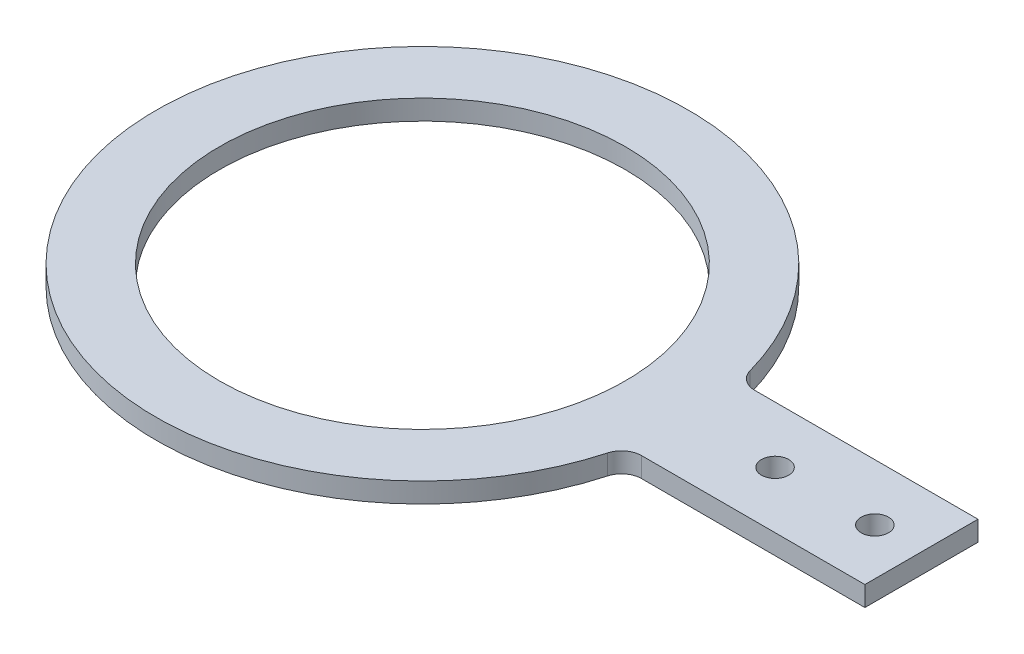
ISO-10303-21;
HEADER;
FILE_DESCRIPTION(('STEP AP214'),'2;1');
FILE_NAME('part.step','',(''),(''),'','','');
FILE_SCHEMA(('AUTOMOTIVE_DESIGN { 1 0 10303 214 1 1 1 1 }'));
ENDSEC;
DATA;
#1=APPLICATION_CONTEXT('core data for automotive mechanical design processes');
#2=APPLICATION_PROTOCOL_DEFINITION('international standard','automotive_design',2000,#1);
#3=PRODUCT_CONTEXT('',#1,'mechanical');
#4=PRODUCT('Part','Part','',(#3));
#5=PRODUCT_RELATED_PRODUCT_CATEGORY('part','',(#4));
#6=PRODUCT_DEFINITION_FORMATION('','',#4);
#7=PRODUCT_DEFINITION_CONTEXT('part definition',#1,'design');
#8=PRODUCT_DEFINITION('design','',#6,#7);
#9=PRODUCT_DEFINITION_SHAPE('','',#8);
#10=(LENGTH_UNIT() NAMED_UNIT(*) SI_UNIT(.MILLI.,.METRE.));
#11=(NAMED_UNIT(*) PLANE_ANGLE_UNIT() SI_UNIT($,.RADIAN.));
#12=(NAMED_UNIT(*) SI_UNIT($,.STERADIAN.) SOLID_ANGLE_UNIT());
#13=UNCERTAINTY_MEASURE_WITH_UNIT(LENGTH_MEASURE(1.E-05),#10,'distance_accuracy_value','');
#14=(GEOMETRIC_REPRESENTATION_CONTEXT(3) GLOBAL_UNCERTAINTY_ASSIGNED_CONTEXT((#13)) GLOBAL_UNIT_ASSIGNED_CONTEXT((#10,
#11,#12)) REPRESENTATION_CONTEXT('',''));
#15=CARTESIAN_POINT('',(0.,0.,0.));
#16=DIRECTION('',(0.,0.,1.));
#17=DIRECTION('',(1.,0.,0.));
#18=AXIS2_PLACEMENT_3D('',#15,#16,#17);
#19=CARTESIAN_POINT('',(0.,3.,0.));
#20=DIRECTION('',(0.,1.,0.));
#21=DIRECTION('',(0.,0.,1.));
#22=AXIS2_PLACEMENT_3D('',#19,#20,#21);
#23=PLANE('',#22);
#24=CARTESIAN_POINT('',(53.,3.,0.));
#25=DIRECTION('',(0.,1.,0.));
#26=DIRECTION('',(0.,0.,1.));
#27=AXIS2_PLACEMENT_3D('',#24,#25,#26);
#28=CIRCLE('',#27,2.05);
#29=CARTESIAN_POINT('',(53.,3.,2.05));
#30=VERTEX_POINT('',#29);
#31=EDGE_CURVE('E205',#30,#30,#28,.T.);
#32=ORIENTED_EDGE('',*,*,#31,.F.);
#33=EDGE_LOOP('',(#32));
#34=FACE_BOUND('',#33,.T.);
#35=CARTESIAN_POINT('',(68.,3.,0.));
#36=DIRECTION('',(0.,1.,0.));
#37=DIRECTION('',(0.,0.,1.));
#38=AXIS2_PLACEMENT_3D('',#35,#36,#37);
#39=CIRCLE('',#38,2.04999999999999);
#40=CARTESIAN_POINT('',(68.,3.,2.04999999999999));
#41=VERTEX_POINT('',#40);
#42=EDGE_CURVE('E203',#41,#41,#39,.T.);
#43=ORIENTED_EDGE('',*,*,#42,.F.);
#44=EDGE_LOOP('',(#43));
#45=FACE_BOUND('',#44,.T.);
#46=DIRECTION('',(-1.,0.,0.));
#47=VECTOR('',#46,1.);
#48=CARTESIAN_POINT('',(35.,3.,-8.5));
#49=LINE('',#48,#47);
#50=CARTESIAN_POINT('',(75.,3.,-8.5));
#51=VERTEX_POINT('',#50);
#52=CARTESIAN_POINT('',(41.4336819507994,3.,-8.5));
#53=VERTEX_POINT('',#52);
#54=EDGE_CURVE('E104',#51,#53,#49,.T.);
#55=ORIENTED_EDGE('',*,*,#54,.T.);
#56=CARTESIAN_POINT('',(41.4336819507994,3.,-11.5));
#57=DIRECTION('',(0.,1.,0.));
#58=DIRECTION('',(0.,0.,1.));
#59=AXIS2_PLACEMENT_3D('',#56,#57,#58);
#60=CIRCLE('',#59,3.);
#61=CARTESIAN_POINT('',(38.542959954232,3.,-10.6976744186046));
#62=VERTEX_POINT('',#61);
#63=EDGE_CURVE('E11',#53,#62,#60,.F.);
#64=ORIENTED_EDGE('',*,*,#63,.T.);
#65=CARTESIAN_POINT('',(0.,3.,0.));
#66=DIRECTION('',(0.,1.,0.));
#67=DIRECTION('',(0.,0.,1.));
#68=AXIS2_PLACEMENT_3D('',#65,#66,#67);
#69=CIRCLE('',#68,40.);
#70=CARTESIAN_POINT('',(38.542959954232,3.,10.6976744186046));
#71=VERTEX_POINT('',#70);
#72=EDGE_CURVE('E123',#62,#71,#69,.T.);
#73=ORIENTED_EDGE('',*,*,#72,.T.);
#74=CARTESIAN_POINT('',(41.4336819507994,3.,11.5));
#75=DIRECTION('',(0.,1.,0.));
#76=DIRECTION('',(0.,0.,1.));
#77=AXIS2_PLACEMENT_3D('',#74,#75,#76);
#78=CIRCLE('',#77,3.);
#79=CARTESIAN_POINT('',(41.4336819507994,3.,8.5));
#80=VERTEX_POINT('',#79);
#81=EDGE_CURVE('E90',#71,#80,#78,.F.);
#82=ORIENTED_EDGE('',*,*,#81,.T.);
#83=DIRECTION('',(1.,0.,0.));
#84=VECTOR('',#83,1.);
#85=CARTESIAN_POINT('',(35.,3.,8.5));
#86=LINE('',#85,#84);
#87=CARTESIAN_POINT('',(75.,3.,8.5));
#88=VERTEX_POINT('',#87);
#89=EDGE_CURVE('E84',#80,#88,#86,.T.);
#90=ORIENTED_EDGE('',*,*,#89,.T.);
#91=DIRECTION('',(0.,0.,-1.));
#92=VECTOR('',#91,1.);
#93=CARTESIAN_POINT('',(75.,3.,-8.5));
#94=LINE('',#93,#92);
#95=EDGE_CURVE('E88',#88,#51,#94,.T.);
#96=ORIENTED_EDGE('',*,*,#95,.T.);
#97=EDGE_LOOP('',(#55,#64,#73,#82,#90,#96));
#98=FACE_BOUND('',#97,.T.);
#99=CARTESIAN_POINT('',(0.,3.,0.));
#100=DIRECTION('',(0.,1.,0.));
#101=DIRECTION('',(0.,0.,1.));
#102=AXIS2_PLACEMENT_3D('',#99,#100,#101);
#103=CIRCLE('',#102,30.5);
#104=CARTESIAN_POINT('',(0.,3.,30.5));
#105=VERTEX_POINT('',#104);
#106=EDGE_CURVE('E117',#105,#105,#103,.T.);
#107=ORIENTED_EDGE('',*,*,#106,.F.);
#108=EDGE_LOOP('',(#107));
#109=FACE_BOUND('',#108,.T.);
#110=ADVANCED_FACE('F32',(#34,#45,#98,#109),#23,.T.);
#111=CARTESIAN_POINT('',(0.,0.,0.));
#112=DIRECTION('',(0.,1.,0.));
#113=DIRECTION('',(0.,0.,1.));
#114=AXIS2_PLACEMENT_3D('',#111,#112,#113);
#115=PLANE('',#114);
#116=CARTESIAN_POINT('',(53.,0.,0.));
#117=DIRECTION('',(0.,1.,0.));
#118=DIRECTION('',(0.,0.,1.));
#119=AXIS2_PLACEMENT_3D('',#116,#117,#118);
#120=CIRCLE('',#119,2.05);
#121=CARTESIAN_POINT('',(53.,0.,2.05));
#122=VERTEX_POINT('',#121);
#123=EDGE_CURVE('E93',#122,#122,#120,.T.);
#124=ORIENTED_EDGE('',*,*,#123,.T.);
#125=EDGE_LOOP('',(#124));
#126=FACE_BOUND('',#125,.T.);
#127=CARTESIAN_POINT('',(68.,0.,0.));
#128=DIRECTION('',(0.,1.,0.));
#129=DIRECTION('',(0.,0.,1.));
#130=AXIS2_PLACEMENT_3D('',#127,#128,#129);
#131=CIRCLE('',#130,2.04999999999999);
#132=CARTESIAN_POINT('',(68.,0.,2.04999999999999));
#133=VERTEX_POINT('',#132);
#134=EDGE_CURVE('E200',#133,#133,#131,.T.);
#135=ORIENTED_EDGE('',*,*,#134,.T.);
#136=EDGE_LOOP('',(#135));
#137=FACE_BOUND('',#136,.T.);
#138=CARTESIAN_POINT('',(0.,0.,0.));
#139=DIRECTION('',(0.,1.,0.));
#140=DIRECTION('',(0.,0.,1.));
#141=AXIS2_PLACEMENT_3D('',#138,#139,#140);
#142=CIRCLE('',#141,40.);
#143=CARTESIAN_POINT('',(38.542959954232,0.,-10.6976744186046));
#144=VERTEX_POINT('',#143);
#145=CARTESIAN_POINT('',(38.542959954232,0.,10.6976744186046));
#146=VERTEX_POINT('',#145);
#147=EDGE_CURVE('E120',#144,#146,#142,.T.);
#148=ORIENTED_EDGE('',*,*,#147,.F.);
#149=CARTESIAN_POINT('',(41.4336819507994,0.,-11.5));
#150=DIRECTION('',(0.,1.,0.));
#151=DIRECTION('',(0.,0.,1.));
#152=AXIS2_PLACEMENT_3D('',#149,#150,#151);
#153=CIRCLE('',#152,3.);
#154=CARTESIAN_POINT('',(41.4336819507994,0.,-8.5));
#155=VERTEX_POINT('',#154);
#156=EDGE_CURVE('E40',#144,#155,#153,.T.);
#157=ORIENTED_EDGE('',*,*,#156,.T.);
#158=DIRECTION('',(1.,0.,0.));
#159=VECTOR('',#158,1.);
#160=CARTESIAN_POINT('',(35.,0.,-8.5));
#161=LINE('',#160,#159);
#162=CARTESIAN_POINT('',(75.,0.,-8.5));
#163=VERTEX_POINT('',#162);
#164=EDGE_CURVE('E116',#155,#163,#161,.T.);
#165=ORIENTED_EDGE('',*,*,#164,.T.);
#166=DIRECTION('',(0.,0.,1.));
#167=VECTOR('',#166,1.);
#168=CARTESIAN_POINT('',(75.,0.,-8.5));
#169=LINE('',#168,#167);
#170=CARTESIAN_POINT('',(75.,0.,8.5));
#171=VERTEX_POINT('',#170);
#172=EDGE_CURVE('E112',#163,#171,#169,.T.);
#173=ORIENTED_EDGE('',*,*,#172,.T.);
#174=DIRECTION('',(-1.,0.,0.));
#175=VECTOR('',#174,1.);
#176=CARTESIAN_POINT('',(35.,0.,8.5));
#177=LINE('',#176,#175);
#178=CARTESIAN_POINT('',(41.4336819507994,0.,8.5));
#179=VERTEX_POINT('',#178);
#180=EDGE_CURVE('E100',#171,#179,#177,.T.);
#181=ORIENTED_EDGE('',*,*,#180,.T.);
#182=CARTESIAN_POINT('',(41.4336819507994,0.,11.5));
#183=DIRECTION('',(0.,1.,0.));
#184=DIRECTION('',(0.,0.,1.));
#185=AXIS2_PLACEMENT_3D('',#182,#183,#184);
#186=CIRCLE('',#185,3.);
#187=EDGE_CURVE('E137',#179,#146,#186,.T.);
#188=ORIENTED_EDGE('',*,*,#187,.T.);
#189=EDGE_LOOP('',(#148,#157,#165,#173,#181,#188));
#190=FACE_BOUND('',#189,.T.);
#191=CARTESIAN_POINT('',(0.,0.,0.));
#192=DIRECTION('',(0.,1.,0.));
#193=DIRECTION('',(0.,0.,1.));
#194=AXIS2_PLACEMENT_3D('',#191,#192,#193);
#195=CIRCLE('',#194,30.5);
#196=CARTESIAN_POINT('',(0.,0.,30.5));
#197=VERTEX_POINT('',#196);
#198=EDGE_CURVE('E115',#197,#197,#195,.T.);
#199=ORIENTED_EDGE('',*,*,#198,.T.);
#200=EDGE_LOOP('',(#199));
#201=FACE_BOUND('',#200,.T.);
#202=ADVANCED_FACE('F139',(#126,#137,#190,#201),#115,.F.);
#203=CARTESIAN_POINT('',(0.,3.,0.));
#204=DIRECTION('',(0.,-1.,0.));
#205=DIRECTION('',(0.,0.,-1.));
#206=AXIS2_PLACEMENT_3D('',#203,#204,#205);
#207=CYLINDRICAL_SURFACE('',#206,40.);
#208=ORIENTED_EDGE('',*,*,#147,.T.);
#209=DIRECTION('',(0.,-1.,0.));
#210=VECTOR('',#209,1.);
#211=CARTESIAN_POINT('',(38.542959954232,3.,10.6976744186047));
#212=LINE('',#211,#210);
#213=EDGE_CURVE('E130',#146,#71,#212,.F.);
#214=ORIENTED_EDGE('',*,*,#213,.T.);
#215=ORIENTED_EDGE('',*,*,#72,.F.);
#216=DIRECTION('',(0.,-1.,0.));
#217=VECTOR('',#216,1.);
#218=CARTESIAN_POINT('',(38.542959954232,3.,-10.6976744186047));
#219=LINE('',#218,#217);
#220=EDGE_CURVE('E125',#62,#144,#219,.T.);
#221=ORIENTED_EDGE('',*,*,#220,.T.);
#222=EDGE_LOOP('',(#208,#214,#215,#221));
#223=FACE_BOUND('',#222,.T.);
#224=ADVANCED_FACE('F144',(#223),#207,.T.);
#225=CARTESIAN_POINT('',(0.,3.,0.));
#226=DIRECTION('',(0.,-1.,0.));
#227=DIRECTION('',(0.,0.,-1.));
#228=AXIS2_PLACEMENT_3D('',#225,#226,#227);
#229=CYLINDRICAL_SURFACE('',#228,30.5);
#230=ORIENTED_EDGE('',*,*,#106,.T.);
#231=EDGE_LOOP('',(#230));
#232=FACE_BOUND('',#231,.T.);
#233=ORIENTED_EDGE('',*,*,#198,.F.);
#234=EDGE_LOOP('',(#233));
#235=FACE_BOUND('',#234,.T.);
#236=ADVANCED_FACE('F170',(#232,#235),#229,.F.);
#237=CARTESIAN_POINT('',(35.,-43.4626276242015,-8.5));
#238=DIRECTION('',(0.,0.,-1.));
#239=DIRECTION('',(-1.,0.,0.));
#240=AXIS2_PLACEMENT_3D('',#237,#238,#239);
#241=PLANE('',#240);
#242=ORIENTED_EDGE('',*,*,#164,.F.);
#243=DIRECTION('',(0.,-1.,0.));
#244=VECTOR('',#243,1.);
#245=CARTESIAN_POINT('',(41.4336819507994,-43.4626276242015,-8.5));
#246=LINE('',#245,#244);
#247=EDGE_CURVE('E53',#155,#53,#246,.F.);
#248=ORIENTED_EDGE('',*,*,#247,.T.);
#249=ORIENTED_EDGE('',*,*,#54,.F.);
#250=DIRECTION('',(0.,1.,0.));
#251=VECTOR('',#250,1.);
#252=CARTESIAN_POINT('',(75.,-43.4626276242015,-8.5));
#253=LINE('',#252,#251);
#254=EDGE_CURVE('E103',#163,#51,#253,.T.);
#255=ORIENTED_EDGE('',*,*,#254,.F.);
#256=EDGE_LOOP('',(#242,#248,#249,#255));
#257=FACE_BOUND('',#256,.T.);
#258=ADVANCED_FACE('F176',(#257),#241,.T.);
#259=CARTESIAN_POINT('',(35.,-43.4626276242015,8.5));
#260=DIRECTION('',(0.,0.,1.));
#261=DIRECTION('',(1.,0.,0.));
#262=AXIS2_PLACEMENT_3D('',#259,#260,#261);
#263=PLANE('',#262);
#264=ORIENTED_EDGE('',*,*,#89,.F.);
#265=DIRECTION('',(0.,-1.,0.));
#266=VECTOR('',#265,1.);
#267=CARTESIAN_POINT('',(41.4336819507994,-43.4626276242015,8.5));
#268=LINE('',#267,#266);
#269=EDGE_CURVE('E133',#80,#179,#268,.T.);
#270=ORIENTED_EDGE('',*,*,#269,.T.);
#271=ORIENTED_EDGE('',*,*,#180,.F.);
#272=DIRECTION('',(0.,1.,0.));
#273=VECTOR('',#272,1.);
#274=CARTESIAN_POINT('',(75.,-43.4626276242015,8.5));
#275=LINE('',#274,#273);
#276=EDGE_CURVE('E97',#171,#88,#275,.T.);
#277=ORIENTED_EDGE('',*,*,#276,.T.);
#278=EDGE_LOOP('',(#264,#270,#271,#277));
#279=FACE_BOUND('',#278,.T.);
#280=ADVANCED_FACE('F98',(#279),#263,.T.);
#281=CARTESIAN_POINT('',(75.,-43.4626276242015,-8.5));
#282=DIRECTION('',(1.,0.,0.));
#283=DIRECTION('',(0.,0.,-1.));
#284=AXIS2_PLACEMENT_3D('',#281,#282,#283);
#285=PLANE('',#284);
#286=ORIENTED_EDGE('',*,*,#172,.F.);
#287=ORIENTED_EDGE('',*,*,#254,.T.);
#288=ORIENTED_EDGE('',*,*,#95,.F.);
#289=ORIENTED_EDGE('',*,*,#276,.F.);
#290=EDGE_LOOP('',(#286,#287,#288,#289));
#291=FACE_BOUND('',#290,.T.);
#292=ADVANCED_FACE('F106',(#291),#285,.T.);
#293=CARTESIAN_POINT('',(68.,0.,0.));
#294=DIRECTION('',(0.,1.,0.));
#295=DIRECTION('',(0.,0.,1.));
#296=AXIS2_PLACEMENT_3D('',#293,#294,#295);
#297=CYLINDRICAL_SURFACE('',#296,2.04999999999999);
#298=ORIENTED_EDGE('',*,*,#134,.F.);
#299=EDGE_LOOP('',(#298));
#300=FACE_BOUND('',#299,.T.);
#301=ORIENTED_EDGE('',*,*,#42,.T.);
#302=EDGE_LOOP('',(#301));
#303=FACE_BOUND('',#302,.T.);
#304=ADVANCED_FACE('F155',(#300,#303),#297,.F.);
#305=CARTESIAN_POINT('',(53.,0.,0.));
#306=DIRECTION('',(0.,1.,0.));
#307=DIRECTION('',(0.,0.,1.));
#308=AXIS2_PLACEMENT_3D('',#305,#306,#307);
#309=CYLINDRICAL_SURFACE('',#308,2.05);
#310=ORIENTED_EDGE('',*,*,#123,.F.);
#311=EDGE_LOOP('',(#310));
#312=FACE_BOUND('',#311,.T.);
#313=ORIENTED_EDGE('',*,*,#31,.T.);
#314=EDGE_LOOP('',(#313));
#315=FACE_BOUND('',#314,.T.);
#316=ADVANCED_FACE('F149',(#312,#315),#309,.F.);
#317=CARTESIAN_POINT('',(41.4336819507994,3.,11.5));
#318=DIRECTION('',(0.,-1.,0.));
#319=DIRECTION('',(0.,0.,-1.));
#320=AXIS2_PLACEMENT_3D('',#317,#318,#319);
#321=CYLINDRICAL_SURFACE('',#320,3.);
#322=ORIENTED_EDGE('',*,*,#187,.F.);
#323=ORIENTED_EDGE('',*,*,#269,.F.);
#324=ORIENTED_EDGE('',*,*,#81,.F.);
#325=ORIENTED_EDGE('',*,*,#213,.F.);
#326=EDGE_LOOP('',(#322,#323,#324,#325));
#327=FACE_BOUND('',#326,.T.);
#328=ADVANCED_FACE('F147',(#327),#321,.F.);
#329=CARTESIAN_POINT('',(41.4336819507994,3.,-11.5));
#330=DIRECTION('',(0.,-1.,0.));
#331=DIRECTION('',(0.,0.,-1.));
#332=AXIS2_PLACEMENT_3D('',#329,#330,#331);
#333=CYLINDRICAL_SURFACE('',#332,3.);
#334=ORIENTED_EDGE('',*,*,#63,.F.);
#335=ORIENTED_EDGE('',*,*,#247,.F.);
#336=ORIENTED_EDGE('',*,*,#156,.F.);
#337=ORIENTED_EDGE('',*,*,#220,.F.);
#338=EDGE_LOOP('',(#334,#335,#336,#337));
#339=FACE_BOUND('',#338,.T.);
#340=ADVANCED_FACE('F34',(#339),#333,.F.);
#341=CLOSED_SHELL('',(#110,#202,#224,#236,#258,#280,#292,#304,#316,#328,#340));
#342=MANIFOLD_SOLID_BREP('B2',#341);
#343=ADVANCED_BREP_SHAPE_REPRESENTATION('',(#18,#342),#14);
#344=SHAPE_DEFINITION_REPRESENTATION(#9,#343);
ENDSEC;
END-ISO-10303-21;
